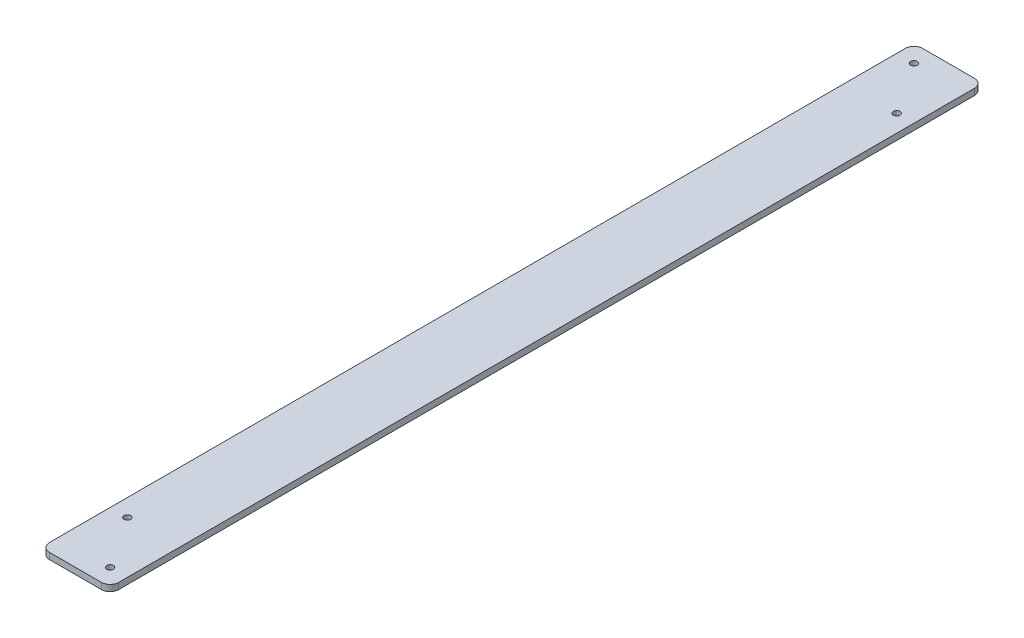
ISO-10303-21;
HEADER;
FILE_DESCRIPTION(('STEP AP214'),'2;1');
FILE_NAME('part.step','',(''),(''),'','','');
FILE_SCHEMA(('AUTOMOTIVE_DESIGN { 1 0 10303 214 1 1 1 1 }'));
ENDSEC;
DATA;
#1=APPLICATION_CONTEXT('core data for automotive mechanical design processes');
#2=APPLICATION_PROTOCOL_DEFINITION('international standard','automotive_design',2000,#1);
#3=PRODUCT_CONTEXT('',#1,'mechanical');
#4=PRODUCT('Part','Part','',(#3));
#5=PRODUCT_RELATED_PRODUCT_CATEGORY('part','',(#4));
#6=PRODUCT_DEFINITION_FORMATION('','',#4);
#7=PRODUCT_DEFINITION_CONTEXT('part definition',#1,'design');
#8=PRODUCT_DEFINITION('design','',#6,#7);
#9=PRODUCT_DEFINITION_SHAPE('','',#8);
#10=(LENGTH_UNIT() NAMED_UNIT(*) SI_UNIT(.MILLI.,.METRE.));
#11=(NAMED_UNIT(*) PLANE_ANGLE_UNIT() SI_UNIT($,.RADIAN.));
#12=(NAMED_UNIT(*) SI_UNIT($,.STERADIAN.) SOLID_ANGLE_UNIT());
#13=UNCERTAINTY_MEASURE_WITH_UNIT(LENGTH_MEASURE(1.E-05),#10,'distance_accuracy_value','');
#14=(GEOMETRIC_REPRESENTATION_CONTEXT(3) GLOBAL_UNCERTAINTY_ASSIGNED_CONTEXT((#13)) GLOBAL_UNIT_ASSIGNED_CONTEXT((#10,
#11,#12)) REPRESENTATION_CONTEXT('',''));
#15=CARTESIAN_POINT('',(0.,0.,0.));
#16=DIRECTION('',(0.,0.,1.));
#17=DIRECTION('',(1.,0.,0.));
#18=AXIS2_PLACEMENT_3D('',#15,#16,#17);
#19=CARTESIAN_POINT('',(0.,0.,0.));
#20=DIRECTION('',(0.,1.,0.));
#21=DIRECTION('',(0.,0.,1.));
#22=AXIS2_PLACEMENT_3D('',#19,#20,#21);
#23=PLANE('',#22);
#24=CARTESIAN_POINT('',(-12.7,0.,-307.975));
#25=DIRECTION('',(0.,-1.,0.));
#26=DIRECTION('',(0.,0.,-1.));
#27=AXIS2_PLACEMENT_3D('',#24,#25,#26);
#28=CIRCLE('',#27,2.4384);
#29=CARTESIAN_POINT('',(-12.7,0.,-310.4134));
#30=VERTEX_POINT('',#29);
#31=EDGE_CURVE('E139',#30,#30,#28,.F.);
#32=ORIENTED_EDGE('',*,*,#31,.T.);
#33=EDGE_LOOP('',(#32));
#34=FACE_BOUND('',#33,.T.);
#35=CARTESIAN_POINT('',(-12.7,0.,269.875));
#36=DIRECTION('',(0.,-1.,0.));
#37=DIRECTION('',(0.,0.,-1.));
#38=AXIS2_PLACEMENT_3D('',#35,#36,#37);
#39=CIRCLE('',#38,2.4384);
#40=CARTESIAN_POINT('',(-12.7,0.,267.4366));
#41=VERTEX_POINT('',#40);
#42=EDGE_CURVE('E142',#41,#41,#39,.F.);
#43=ORIENTED_EDGE('',*,*,#42,.T.);
#44=EDGE_LOOP('',(#43));
#45=FACE_BOUND('',#44,.T.);
#46=CARTESIAN_POINT('',(12.7,0.,307.975));
#47=DIRECTION('',(0.,-1.,0.));
#48=DIRECTION('',(0.,0.,-1.));
#49=AXIS2_PLACEMENT_3D('',#46,#47,#48);
#50=CIRCLE('',#49,2.4384);
#51=CARTESIAN_POINT('',(12.7,0.,305.5366));
#52=VERTEX_POINT('',#51);
#53=EDGE_CURVE('E145',#52,#52,#50,.F.);
#54=ORIENTED_EDGE('',*,*,#53,.T.);
#55=EDGE_LOOP('',(#54));
#56=FACE_BOUND('',#55,.T.);
#57=CARTESIAN_POINT('',(12.7,0.,-269.875));
#58=DIRECTION('',(0.,-1.,0.));
#59=DIRECTION('',(0.,0.,-1.));
#60=AXIS2_PLACEMENT_3D('',#57,#58,#59);
#61=CIRCLE('',#60,2.4384);
#62=CARTESIAN_POINT('',(12.7,0.,-272.3134));
#63=VERTEX_POINT('',#62);
#64=EDGE_CURVE('E148',#63,#63,#61,.F.);
#65=ORIENTED_EDGE('',*,*,#64,.T.);
#66=EDGE_LOOP('',(#65));
#67=FACE_BOUND('',#66,.T.);
#68=CARTESIAN_POINT('',(19.05,0.,314.325));
#69=DIRECTION('',(0.,-1.,0.));
#70=DIRECTION('',(0.,0.,-1.));
#71=AXIS2_PLACEMENT_3D('',#68,#69,#70);
#72=CIRCLE('',#71,6.35);
#73=CARTESIAN_POINT('',(19.05,0.,320.675));
#74=VERTEX_POINT('',#73);
#75=CARTESIAN_POINT('',(25.4,0.,314.325));
#76=VERTEX_POINT('',#75);
#77=EDGE_CURVE('E154',#74,#76,#72,.F.);
#78=ORIENTED_EDGE('',*,*,#77,.F.);
#79=DIRECTION('',(1.,0.,0.));
#80=VECTOR('',#79,1.);
#81=CARTESIAN_POINT('',(-25.4,0.,320.675));
#82=LINE('',#81,#80);
#83=CARTESIAN_POINT('',(-19.05,0.,320.675));
#84=VERTEX_POINT('',#83);
#85=EDGE_CURVE('E113',#84,#74,#82,.T.);
#86=ORIENTED_EDGE('',*,*,#85,.F.);
#87=CARTESIAN_POINT('',(-19.05,0.,314.325));
#88=DIRECTION('',(0.,-1.,0.));
#89=DIRECTION('',(0.,0.,-1.));
#90=AXIS2_PLACEMENT_3D('',#87,#88,#89);
#91=CIRCLE('',#90,6.35);
#92=CARTESIAN_POINT('',(-25.4,0.,314.325));
#93=VERTEX_POINT('',#92);
#94=EDGE_CURVE('E87',#93,#84,#91,.F.);
#95=ORIENTED_EDGE('',*,*,#94,.F.);
#96=DIRECTION('',(0.,0.,1.));
#97=VECTOR('',#96,1.);
#98=CARTESIAN_POINT('',(-25.4,0.,-320.675));
#99=LINE('',#98,#97);
#100=CARTESIAN_POINT('',(-25.4,0.,-314.325));
#101=VERTEX_POINT('',#100);
#102=EDGE_CURVE('E82',#101,#93,#99,.T.);
#103=ORIENTED_EDGE('',*,*,#102,.F.);
#104=CARTESIAN_POINT('',(-19.05,0.,-314.325));
#105=DIRECTION('',(0.,-1.,0.));
#106=DIRECTION('',(0.,0.,-1.));
#107=AXIS2_PLACEMENT_3D('',#104,#105,#106);
#108=CIRCLE('',#107,6.35);
#109=CARTESIAN_POINT('',(-19.05,0.,-320.675));
#110=VERTEX_POINT('',#109);
#111=EDGE_CURVE('E19',#110,#101,#108,.F.);
#112=ORIENTED_EDGE('',*,*,#111,.F.);
#113=DIRECTION('',(-1.,0.,0.));
#114=VECTOR('',#113,1.);
#115=CARTESIAN_POINT('',(25.4,0.,-320.675));
#116=LINE('',#115,#114);
#117=CARTESIAN_POINT('',(19.05,0.,-320.675));
#118=VERTEX_POINT('',#117);
#119=EDGE_CURVE('E77',#118,#110,#116,.T.);
#120=ORIENTED_EDGE('',*,*,#119,.F.);
#121=CARTESIAN_POINT('',(19.05,0.,-314.325));
#122=DIRECTION('',(0.,-1.,0.));
#123=DIRECTION('',(0.,0.,-1.));
#124=AXIS2_PLACEMENT_3D('',#121,#122,#123);
#125=CIRCLE('',#124,6.35);
#126=CARTESIAN_POINT('',(25.4,0.,-314.325));
#127=VERTEX_POINT('',#126);
#128=EDGE_CURVE('E151',#127,#118,#125,.F.);
#129=ORIENTED_EDGE('',*,*,#128,.F.);
#130=DIRECTION('',(0.,0.,-1.));
#131=VECTOR('',#130,1.);
#132=CARTESIAN_POINT('',(25.4,0.,320.675));
#133=LINE('',#132,#131);
#134=EDGE_CURVE('E108',#76,#127,#133,.T.);
#135=ORIENTED_EDGE('',*,*,#134,.F.);
#136=EDGE_LOOP('',(#78,#86,#95,#103,#112,#120,#129,#135));
#137=FACE_BOUND('',#136,.T.);
#138=ADVANCED_FACE('F16',(#34,#45,#56,#67,#137),#23,.F.);
#139=CARTESIAN_POINT('',(25.4,0.,-320.675));
#140=DIRECTION('',(0.,0.,-1.));
#141=DIRECTION('',(-1.,0.,0.));
#142=AXIS2_PLACEMENT_3D('',#139,#140,#141);
#143=PLANE('',#142);
#144=DIRECTION('',(1.,0.,0.));
#145=VECTOR('',#144,1.);
#146=CARTESIAN_POINT('',(0.,4.62026,-320.675));
#147=LINE('',#146,#145);
#148=CARTESIAN_POINT('',(19.05,4.62026,-320.675));
#149=VERTEX_POINT('',#148);
#150=CARTESIAN_POINT('',(-19.05,4.62026,-320.675));
#151=VERTEX_POINT('',#150);
#152=EDGE_CURVE('E138',#149,#151,#147,.F.);
#153=ORIENTED_EDGE('',*,*,#152,.F.);
#154=DIRECTION('',(0.,-1.,0.));
#155=VECTOR('',#154,1.);
#156=CARTESIAN_POINT('',(19.05,12.723070312,-320.675));
#157=LINE('',#156,#155);
#158=EDGE_CURVE('E110',#118,#149,#157,.F.);
#159=ORIENTED_EDGE('',*,*,#158,.F.);
#160=ORIENTED_EDGE('',*,*,#119,.T.);
#161=DIRECTION('',(0.,-1.,0.));
#162=VECTOR('',#161,1.);
#163=CARTESIAN_POINT('',(-19.05,12.723070312,-320.675));
#164=LINE('',#163,#162);
#165=EDGE_CURVE('E97',#151,#110,#164,.T.);
#166=ORIENTED_EDGE('',*,*,#165,.F.);
#167=EDGE_LOOP('',(#153,#159,#160,#166));
#168=FACE_BOUND('',#167,.T.);
#169=ADVANCED_FACE('F183',(#168),#143,.T.);
#170=CARTESIAN_POINT('',(-19.05,12.723070312,-314.325));
#171=DIRECTION('',(0.,-1.,0.));
#172=DIRECTION('',(0.,0.,-1.));
#173=AXIS2_PLACEMENT_3D('',#170,#171,#172);
#174=CYLINDRICAL_SURFACE('',#173,6.35);
#175=ORIENTED_EDGE('',*,*,#165,.T.);
#176=ORIENTED_EDGE('',*,*,#111,.T.);
#177=DIRECTION('',(0.,1.,0.));
#178=VECTOR('',#177,1.);
#179=CARTESIAN_POINT('',(-25.4,0.,-314.325));
#180=LINE('',#179,#178);
#181=CARTESIAN_POINT('',(-25.4,4.62026,-314.325));
#182=VERTEX_POINT('',#181);
#183=EDGE_CURVE('E91',#182,#101,#180,.F.);
#184=ORIENTED_EDGE('',*,*,#183,.F.);
#185=CARTESIAN_POINT('',(-19.05,4.62026,-314.325));
#186=DIRECTION('',(0.,-1.,0.));
#187=DIRECTION('',(0.,0.,-1.));
#188=AXIS2_PLACEMENT_3D('',#185,#186,#187);
#189=CIRCLE('',#188,6.35);
#190=EDGE_CURVE('E136',#151,#182,#189,.F.);
#191=ORIENTED_EDGE('',*,*,#190,.F.);
#192=EDGE_LOOP('',(#175,#176,#184,#191));
#193=FACE_BOUND('',#192,.T.);
#194=ADVANCED_FACE('F94',(#193),#174,.T.);
#195=CARTESIAN_POINT('',(-25.4,0.,-320.675));
#196=DIRECTION('',(-1.,0.,0.));
#197=DIRECTION('',(0.,0.,1.));
#198=AXIS2_PLACEMENT_3D('',#195,#196,#197);
#199=PLANE('',#198);
#200=DIRECTION('',(0.,0.,1.));
#201=VECTOR('',#200,1.);
#202=CARTESIAN_POINT('',(-25.4,4.62026,0.));
#203=LINE('',#202,#201);
#204=CARTESIAN_POINT('',(-25.4,4.62026,314.325));
#205=VERTEX_POINT('',#204);
#206=EDGE_CURVE('E100',#182,#205,#203,.T.);
#207=ORIENTED_EDGE('',*,*,#206,.F.);
#208=ORIENTED_EDGE('',*,*,#183,.T.);
#209=ORIENTED_EDGE('',*,*,#102,.T.);
#210=DIRECTION('',(0.,-1.,0.));
#211=VECTOR('',#210,1.);
#212=CARTESIAN_POINT('',(-25.4,12.723070312,314.325));
#213=LINE('',#212,#211);
#214=EDGE_CURVE('E102',#205,#93,#213,.T.);
#215=ORIENTED_EDGE('',*,*,#214,.F.);
#216=EDGE_LOOP('',(#207,#208,#209,#215));
#217=FACE_BOUND('',#216,.T.);
#218=ADVANCED_FACE('F98',(#217),#199,.T.);
#219=CARTESIAN_POINT('',(-19.05,12.723070312,314.325));
#220=DIRECTION('',(0.,-1.,0.));
#221=DIRECTION('',(0.,0.,-1.));
#222=AXIS2_PLACEMENT_3D('',#219,#220,#221);
#223=CYLINDRICAL_SURFACE('',#222,6.35);
#224=ORIENTED_EDGE('',*,*,#214,.T.);
#225=ORIENTED_EDGE('',*,*,#94,.T.);
#226=DIRECTION('',(0.,1.,0.));
#227=VECTOR('',#226,1.);
#228=CARTESIAN_POINT('',(-19.05,0.,320.675));
#229=LINE('',#228,#227);
#230=CARTESIAN_POINT('',(-19.05,4.62026,320.675));
#231=VERTEX_POINT('',#230);
#232=EDGE_CURVE('E115',#231,#84,#229,.F.);
#233=ORIENTED_EDGE('',*,*,#232,.F.);
#234=CARTESIAN_POINT('',(-19.05,4.62026,314.325));
#235=DIRECTION('',(0.,-1.,0.));
#236=DIRECTION('',(0.,0.,-1.));
#237=AXIS2_PLACEMENT_3D('',#234,#235,#236);
#238=CIRCLE('',#237,6.35);
#239=EDGE_CURVE('E133',#205,#231,#238,.F.);
#240=ORIENTED_EDGE('',*,*,#239,.F.);
#241=EDGE_LOOP('',(#224,#225,#233,#240));
#242=FACE_BOUND('',#241,.T.);
#243=ADVANCED_FACE('F185',(#242),#223,.T.);
#244=CARTESIAN_POINT('',(-25.4,0.,320.675));
#245=DIRECTION('',(0.,0.,1.));
#246=DIRECTION('',(1.,0.,0.));
#247=AXIS2_PLACEMENT_3D('',#244,#245,#246);
#248=PLANE('',#247);
#249=ORIENTED_EDGE('',*,*,#85,.T.);
#250=DIRECTION('',(0.,-1.,0.));
#251=VECTOR('',#250,1.);
#252=CARTESIAN_POINT('',(19.05,12.723070312,320.675));
#253=LINE('',#252,#251);
#254=CARTESIAN_POINT('',(19.05,4.62026,320.675));
#255=VERTEX_POINT('',#254);
#256=EDGE_CURVE('E114',#255,#74,#253,.T.);
#257=ORIENTED_EDGE('',*,*,#256,.F.);
#258=DIRECTION('',(1.,0.,0.));
#259=VECTOR('',#258,1.);
#260=CARTESIAN_POINT('',(0.,4.62026,320.675));
#261=LINE('',#260,#259);
#262=EDGE_CURVE('E132',#231,#255,#261,.T.);
#263=ORIENTED_EDGE('',*,*,#262,.F.);
#264=ORIENTED_EDGE('',*,*,#232,.T.);
#265=EDGE_LOOP('',(#249,#257,#263,#264));
#266=FACE_BOUND('',#265,.T.);
#267=ADVANCED_FACE('F186',(#266),#248,.T.);
#268=CARTESIAN_POINT('',(19.05,12.723070312,314.325));
#269=DIRECTION('',(0.,-1.,0.));
#270=DIRECTION('',(0.,0.,-1.));
#271=AXIS2_PLACEMENT_3D('',#268,#269,#270);
#272=CYLINDRICAL_SURFACE('',#271,6.35);
#273=ORIENTED_EDGE('',*,*,#256,.T.);
#274=ORIENTED_EDGE('',*,*,#77,.T.);
#275=DIRECTION('',(0.,1.,0.));
#276=VECTOR('',#275,1.);
#277=CARTESIAN_POINT('',(25.4,0.,314.325));
#278=LINE('',#277,#276);
#279=CARTESIAN_POINT('',(25.4,4.62026,314.325));
#280=VERTEX_POINT('',#279);
#281=EDGE_CURVE('E111',#280,#76,#278,.F.);
#282=ORIENTED_EDGE('',*,*,#281,.F.);
#283=CARTESIAN_POINT('',(19.05,4.62026,314.325));
#284=DIRECTION('',(0.,-1.,0.));
#285=DIRECTION('',(0.,0.,-1.));
#286=AXIS2_PLACEMENT_3D('',#283,#284,#285);
#287=CIRCLE('',#286,6.35);
#288=EDGE_CURVE('E129',#255,#280,#287,.F.);
#289=ORIENTED_EDGE('',*,*,#288,.F.);
#290=EDGE_LOOP('',(#273,#274,#282,#289));
#291=FACE_BOUND('',#290,.T.);
#292=ADVANCED_FACE('F180',(#291),#272,.T.);
#293=CARTESIAN_POINT('',(25.4,0.,320.675));
#294=DIRECTION('',(1.,0.,0.));
#295=DIRECTION('',(0.,0.,-1.));
#296=AXIS2_PLACEMENT_3D('',#293,#294,#295);
#297=PLANE('',#296);
#298=ORIENTED_EDGE('',*,*,#134,.T.);
#299=DIRECTION('',(0.,-1.,0.));
#300=VECTOR('',#299,1.);
#301=CARTESIAN_POINT('',(25.4,12.723070312,-314.325));
#302=LINE('',#301,#300);
#303=CARTESIAN_POINT('',(25.4,4.62026,-314.325));
#304=VERTEX_POINT('',#303);
#305=EDGE_CURVE('E34',#304,#127,#302,.T.);
#306=ORIENTED_EDGE('',*,*,#305,.F.);
#307=DIRECTION('',(0.,0.,1.));
#308=VECTOR('',#307,1.);
#309=CARTESIAN_POINT('',(25.4,4.62026,0.));
#310=LINE('',#309,#308);
#311=EDGE_CURVE('E128',#280,#304,#310,.F.);
#312=ORIENTED_EDGE('',*,*,#311,.F.);
#313=ORIENTED_EDGE('',*,*,#281,.T.);
#314=EDGE_LOOP('',(#298,#306,#312,#313));
#315=FACE_BOUND('',#314,.T.);
#316=ADVANCED_FACE('F176',(#315),#297,.T.);
#317=CARTESIAN_POINT('',(19.05,12.723070312,-314.325));
#318=DIRECTION('',(0.,-1.,0.));
#319=DIRECTION('',(0.,0.,-1.));
#320=AXIS2_PLACEMENT_3D('',#317,#318,#319);
#321=CYLINDRICAL_SURFACE('',#320,6.35);
#322=ORIENTED_EDGE('',*,*,#305,.T.);
#323=ORIENTED_EDGE('',*,*,#128,.T.);
#324=ORIENTED_EDGE('',*,*,#158,.T.);
#325=CARTESIAN_POINT('',(19.05,4.62026,-314.325));
#326=DIRECTION('',(0.,-1.,0.));
#327=DIRECTION('',(0.,0.,-1.));
#328=AXIS2_PLACEMENT_3D('',#325,#326,#327);
#329=CIRCLE('',#328,6.35);
#330=EDGE_CURVE('E125',#304,#149,#329,.F.);
#331=ORIENTED_EDGE('',*,*,#330,.F.);
#332=EDGE_LOOP('',(#322,#323,#324,#331));
#333=FACE_BOUND('',#332,.T.);
#334=ADVANCED_FACE('F182',(#333),#321,.T.);
#335=CARTESIAN_POINT('',(12.7,4.62026,-269.875));
#336=DIRECTION('',(0.,-1.,0.));
#337=DIRECTION('',(0.,0.,-1.));
#338=AXIS2_PLACEMENT_3D('',#335,#336,#337);
#339=CYLINDRICAL_SURFACE('',#338,2.4384);
#340=CARTESIAN_POINT('',(12.7,4.62026,-269.875));
#341=DIRECTION('',(0.,-1.,0.));
#342=DIRECTION('',(0.,0.,-1.));
#343=AXIS2_PLACEMENT_3D('',#340,#341,#342);
#344=CIRCLE('',#343,2.4384);
#345=CARTESIAN_POINT('',(12.7,4.62026,-272.3134));
#346=VERTEX_POINT('',#345);
#347=EDGE_CURVE('E122',#346,#346,#344,.T.);
#348=ORIENTED_EDGE('',*,*,#347,.F.);
#349=EDGE_LOOP('',(#348));
#350=FACE_BOUND('',#349,.T.);
#351=ORIENTED_EDGE('',*,*,#64,.F.);
#352=EDGE_LOOP('',(#351));
#353=FACE_BOUND('',#352,.T.);
#354=ADVANCED_FACE('F214',(#350,#353),#339,.F.);
#355=CARTESIAN_POINT('',(12.7,4.62026,307.975));
#356=DIRECTION('',(0.,-1.,0.));
#357=DIRECTION('',(0.,0.,-1.));
#358=AXIS2_PLACEMENT_3D('',#355,#356,#357);
#359=CYLINDRICAL_SURFACE('',#358,2.4384);
#360=CARTESIAN_POINT('',(12.7,4.62026,307.975));
#361=DIRECTION('',(0.,-1.,0.));
#362=DIRECTION('',(0.,0.,-1.));
#363=AXIS2_PLACEMENT_3D('',#360,#361,#362);
#364=CIRCLE('',#363,2.4384);
#365=CARTESIAN_POINT('',(12.7,4.62026,305.5366));
#366=VERTEX_POINT('',#365);
#367=EDGE_CURVE('E119',#366,#366,#364,.T.);
#368=ORIENTED_EDGE('',*,*,#367,.F.);
#369=EDGE_LOOP('',(#368));
#370=FACE_BOUND('',#369,.T.);
#371=ORIENTED_EDGE('',*,*,#53,.F.);
#372=EDGE_LOOP('',(#371));
#373=FACE_BOUND('',#372,.T.);
#374=ADVANCED_FACE('F210',(#370,#373),#359,.F.);
#375=CARTESIAN_POINT('',(-12.7,4.62026,269.875));
#376=DIRECTION('',(0.,-1.,0.));
#377=DIRECTION('',(0.,0.,-1.));
#378=AXIS2_PLACEMENT_3D('',#375,#376,#377);
#379=CYLINDRICAL_SURFACE('',#378,2.4384);
#380=CARTESIAN_POINT('',(-12.7,4.62026,269.875));
#381=DIRECTION('',(0.,-1.,0.));
#382=DIRECTION('',(0.,0.,-1.));
#383=AXIS2_PLACEMENT_3D('',#380,#381,#382);
#384=CIRCLE('',#383,2.4384);
#385=CARTESIAN_POINT('',(-12.7,4.62026,267.4366));
#386=VERTEX_POINT('',#385);
#387=EDGE_CURVE('E25',#386,#386,#384,.T.);
#388=ORIENTED_EDGE('',*,*,#387,.F.);
#389=EDGE_LOOP('',(#388));
#390=FACE_BOUND('',#389,.T.);
#391=ORIENTED_EDGE('',*,*,#42,.F.);
#392=EDGE_LOOP('',(#391));
#393=FACE_BOUND('',#392,.T.);
#394=ADVANCED_FACE('F203',(#390,#393),#379,.F.);
#395=CARTESIAN_POINT('',(-12.7,4.62026,-307.975));
#396=DIRECTION('',(0.,-1.,0.));
#397=DIRECTION('',(0.,0.,-1.));
#398=AXIS2_PLACEMENT_3D('',#395,#396,#397);
#399=CYLINDRICAL_SURFACE('',#398,2.4384);
#400=CARTESIAN_POINT('',(-12.7,4.62026,-307.975));
#401=DIRECTION('',(0.,-1.,0.));
#402=DIRECTION('',(0.,0.,-1.));
#403=AXIS2_PLACEMENT_3D('',#400,#401,#402);
#404=CIRCLE('',#403,2.4384);
#405=CARTESIAN_POINT('',(-12.7,4.62026,-310.4134));
#406=VERTEX_POINT('',#405);
#407=EDGE_CURVE('E11',#406,#406,#404,.T.);
#408=ORIENTED_EDGE('',*,*,#407,.F.);
#409=EDGE_LOOP('',(#408));
#410=FACE_BOUND('',#409,.T.);
#411=ORIENTED_EDGE('',*,*,#31,.F.);
#412=EDGE_LOOP('',(#411));
#413=FACE_BOUND('',#412,.T.);
#414=ADVANCED_FACE('F197',(#410,#413),#399,.F.);
#415=CARTESIAN_POINT('',(0.,4.62026,0.));
#416=DIRECTION('',(0.,1.,0.));
#417=DIRECTION('',(0.,0.,1.));
#418=AXIS2_PLACEMENT_3D('',#415,#416,#417);
#419=PLANE('',#418);
#420=ORIENTED_EDGE('',*,*,#407,.T.);
#421=EDGE_LOOP('',(#420));
#422=FACE_BOUND('',#421,.T.);
#423=ORIENTED_EDGE('',*,*,#387,.T.);
#424=EDGE_LOOP('',(#423));
#425=FACE_BOUND('',#424,.T.);
#426=ORIENTED_EDGE('',*,*,#367,.T.);
#427=EDGE_LOOP('',(#426));
#428=FACE_BOUND('',#427,.T.);
#429=ORIENTED_EDGE('',*,*,#347,.T.);
#430=EDGE_LOOP('',(#429));
#431=FACE_BOUND('',#430,.T.);
#432=ORIENTED_EDGE('',*,*,#311,.T.);
#433=ORIENTED_EDGE('',*,*,#330,.T.);
#434=ORIENTED_EDGE('',*,*,#152,.T.);
#435=ORIENTED_EDGE('',*,*,#190,.T.);
#436=ORIENTED_EDGE('',*,*,#206,.T.);
#437=ORIENTED_EDGE('',*,*,#239,.T.);
#438=ORIENTED_EDGE('',*,*,#262,.T.);
#439=ORIENTED_EDGE('',*,*,#288,.T.);
#440=EDGE_LOOP('',(#432,#433,#434,#435,#436,#437,#438,#439));
#441=FACE_BOUND('',#440,.T.);
#442=ADVANCED_FACE('F174',(#422,#425,#428,#431,#441),#419,.T.);
#443=CLOSED_SHELL('',(#138,#169,#194,#218,#243,#267,#292,#316,#334,#354,#374,#394,#414,#442));
#444=MANIFOLD_SOLID_BREP('B1',#443);
#445=ADVANCED_BREP_SHAPE_REPRESENTATION('',(#18,#444),#14);
#446=SHAPE_DEFINITION_REPRESENTATION(#9,#445);
ENDSEC;
END-ISO-10303-21;
